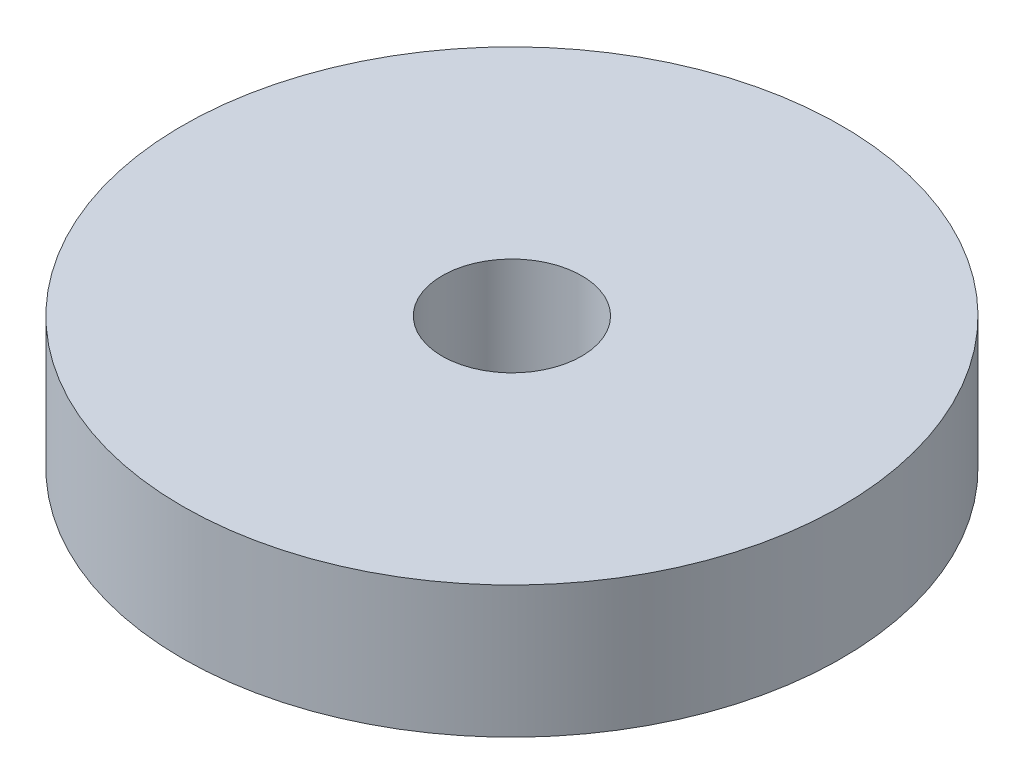
ISO-10303-21;
HEADER;
FILE_DESCRIPTION(('STEP AP214'),'2;1');
FILE_NAME('part.step','',(''),(''),'','','');
FILE_SCHEMA(('AUTOMOTIVE_DESIGN { 1 0 10303 214 1 1 1 1 }'));
ENDSEC;
DATA;
#1=APPLICATION_CONTEXT('core data for automotive mechanical design processes');
#2=APPLICATION_PROTOCOL_DEFINITION('international standard','automotive_design',2000,#1);
#3=PRODUCT_CONTEXT('',#1,'mechanical');
#4=PRODUCT('Part','Part','',(#3));
#5=PRODUCT_RELATED_PRODUCT_CATEGORY('part','',(#4));
#6=PRODUCT_DEFINITION_FORMATION('','',#4);
#7=PRODUCT_DEFINITION_CONTEXT('part definition',#1,'design');
#8=PRODUCT_DEFINITION('design','',#6,#7);
#9=PRODUCT_DEFINITION_SHAPE('','',#8);
#10=(LENGTH_UNIT() NAMED_UNIT(*) SI_UNIT(.MILLI.,.METRE.));
#11=(NAMED_UNIT(*) PLANE_ANGLE_UNIT() SI_UNIT($,.RADIAN.));
#12=(NAMED_UNIT(*) SI_UNIT($,.STERADIAN.) SOLID_ANGLE_UNIT());
#13=UNCERTAINTY_MEASURE_WITH_UNIT(LENGTH_MEASURE(1.E-05),#10,'distance_accuracy_value','');
#14=(GEOMETRIC_REPRESENTATION_CONTEXT(3) GLOBAL_UNCERTAINTY_ASSIGNED_CONTEXT((#13)) GLOBAL_UNIT_ASSIGNED_CONTEXT((#10,
#11,#12)) REPRESENTATION_CONTEXT('',''));
#15=CARTESIAN_POINT('',(0.,0.,0.));
#16=DIRECTION('',(0.,0.,1.));
#17=DIRECTION('',(1.,0.,0.));
#18=AXIS2_PLACEMENT_3D('',#15,#16,#17);
#19=CARTESIAN_POINT('',(0.,12.0000014,0.));
#20=DIRECTION('',(0.,-1.,0.));
#21=DIRECTION('',(0.,0.,-1.));
#22=AXIS2_PLACEMENT_3D('',#19,#20,#21);
#23=CYLINDRICAL_SURFACE('',#22,29.99994);
#24=CARTESIAN_POINT('',(0.,12.0000014,0.));
#25=DIRECTION('',(0.,1.,0.));
#26=DIRECTION('',(0.,0.,1.));
#27=AXIS2_PLACEMENT_3D('',#24,#25,#26);
#28=CIRCLE('',#27,29.99994);
#29=CARTESIAN_POINT('',(0.,12.0000014,29.99994));
#30=VERTEX_POINT('',#29);
#31=EDGE_CURVE('E10',#30,#30,#28,.T.);
#32=ORIENTED_EDGE('',*,*,#31,.F.);
#33=EDGE_LOOP('',(#32));
#34=FACE_BOUND('',#33,.T.);
#35=CARTESIAN_POINT('',(0.,0.,0.));
#36=DIRECTION('',(0.,1.,0.));
#37=DIRECTION('',(0.,0.,1.));
#38=AXIS2_PLACEMENT_3D('',#35,#36,#37);
#39=CIRCLE('',#38,29.99994);
#40=CARTESIAN_POINT('',(0.,0.,29.99994));
#41=VERTEX_POINT('',#40);
#42=EDGE_CURVE('E34',#41,#41,#39,.T.);
#43=ORIENTED_EDGE('',*,*,#42,.T.);
#44=EDGE_LOOP('',(#43));
#45=FACE_BOUND('',#44,.T.);
#46=ADVANCED_FACE('F31',(#34,#45),#23,.T.);
#47=CARTESIAN_POINT('',(0.,12.0000014,0.));
#48=DIRECTION('',(0.,1.,0.));
#49=DIRECTION('',(0.,0.,1.));
#50=AXIS2_PLACEMENT_3D('',#47,#48,#49);
#51=PLANE('',#50);
#52=CARTESIAN_POINT('',(0.,12.0000014,0.));
#53=DIRECTION('',(0.,1.,0.));
#54=DIRECTION('',(0.,0.,1.));
#55=AXIS2_PLACEMENT_3D('',#52,#53,#54);
#56=CIRCLE('',#55,6.35);
#57=CARTESIAN_POINT('',(0.,12.0000014,6.35));
#58=VERTEX_POINT('',#57);
#59=EDGE_CURVE('E43',#58,#58,#56,.T.);
#60=ORIENTED_EDGE('',*,*,#59,.F.);
#61=EDGE_LOOP('',(#60));
#62=FACE_BOUND('',#61,.T.);
#63=ORIENTED_EDGE('',*,*,#31,.T.);
#64=EDGE_LOOP('',(#63));
#65=FACE_BOUND('',#64,.T.);
#66=ADVANCED_FACE('F58',(#62,#65),#51,.T.);
#67=CARTESIAN_POINT('',(0.,0.,0.));
#68=DIRECTION('',(0.,1.,0.));
#69=DIRECTION('',(0.,0.,1.));
#70=AXIS2_PLACEMENT_3D('',#67,#68,#69);
#71=PLANE('',#70);
#72=CARTESIAN_POINT('',(0.,0.,0.));
#73=DIRECTION('',(0.,1.,0.));
#74=DIRECTION('',(0.,0.,1.));
#75=AXIS2_PLACEMENT_3D('',#72,#73,#74);
#76=CIRCLE('',#75,6.35);
#77=CARTESIAN_POINT('',(0.,0.,6.35));
#78=VERTEX_POINT('',#77);
#79=EDGE_CURVE('E41',#78,#78,#76,.T.);
#80=ORIENTED_EDGE('',*,*,#79,.T.);
#81=EDGE_LOOP('',(#80));
#82=FACE_BOUND('',#81,.T.);
#83=ORIENTED_EDGE('',*,*,#42,.F.);
#84=EDGE_LOOP('',(#83));
#85=FACE_BOUND('',#84,.T.);
#86=ADVANCED_FACE('F49',(#82,#85),#71,.F.);
#87=CARTESIAN_POINT('',(0.,0.,0.));
#88=DIRECTION('',(0.,1.,0.));
#89=DIRECTION('',(0.,0.,1.));
#90=AXIS2_PLACEMENT_3D('',#87,#88,#89);
#91=CYLINDRICAL_SURFACE('',#90,6.35);
#92=ORIENTED_EDGE('',*,*,#79,.F.);
#93=EDGE_LOOP('',(#92));
#94=FACE_BOUND('',#93,.T.);
#95=ORIENTED_EDGE('',*,*,#59,.T.);
#96=EDGE_LOOP('',(#95));
#97=FACE_BOUND('',#96,.T.);
#98=ADVANCED_FACE('F52',(#94,#97),#91,.F.);
#99=CLOSED_SHELL('',(#46,#66,#86,#98));
#100=MANIFOLD_SOLID_BREP('B2',#99);
#101=ADVANCED_BREP_SHAPE_REPRESENTATION('',(#18,#100),#14);
#102=SHAPE_DEFINITION_REPRESENTATION(#9,#101);
ENDSEC;
END-ISO-10303-21;
